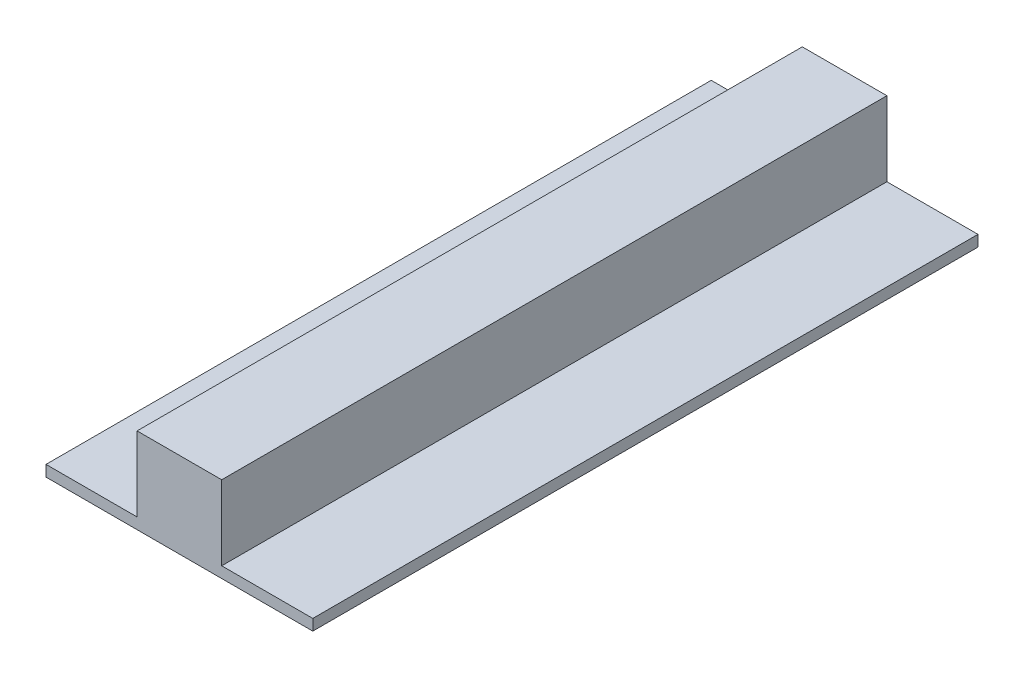
ISO-10303-21;
HEADER;
FILE_DESCRIPTION(('STEP AP214'),'2;1');
FILE_NAME('part.step','',(''),(''),'','','');
FILE_SCHEMA(('AUTOMOTIVE_DESIGN { 1 0 10303 214 1 1 1 1 }'));
ENDSEC;
DATA;
#1=APPLICATION_CONTEXT('core data for automotive mechanical design processes');
#2=APPLICATION_PROTOCOL_DEFINITION('international standard','automotive_design',2000,#1);
#3=PRODUCT_CONTEXT('',#1,'mechanical');
#4=PRODUCT('Part','Part','',(#3));
#5=PRODUCT_RELATED_PRODUCT_CATEGORY('part','',(#4));
#6=PRODUCT_DEFINITION_FORMATION('','',#4);
#7=PRODUCT_DEFINITION_CONTEXT('part definition',#1,'design');
#8=PRODUCT_DEFINITION('design','',#6,#7);
#9=PRODUCT_DEFINITION_SHAPE('','',#8);
#10=(LENGTH_UNIT() NAMED_UNIT(*) SI_UNIT(.MILLI.,.METRE.));
#11=(NAMED_UNIT(*) PLANE_ANGLE_UNIT() SI_UNIT($,.RADIAN.));
#12=(NAMED_UNIT(*) SI_UNIT($,.STERADIAN.) SOLID_ANGLE_UNIT());
#13=UNCERTAINTY_MEASURE_WITH_UNIT(LENGTH_MEASURE(1.E-05),#10,'distance_accuracy_value','');
#14=(GEOMETRIC_REPRESENTATION_CONTEXT(3) GLOBAL_UNCERTAINTY_ASSIGNED_CONTEXT((#13)) GLOBAL_UNIT_ASSIGNED_CONTEXT((#10,
#11,#12)) REPRESENTATION_CONTEXT('',''));
#15=CARTESIAN_POINT('',(0.,0.,0.));
#16=DIRECTION('',(0.,0.,1.));
#17=DIRECTION('',(1.,0.,0.));
#18=AXIS2_PLACEMENT_3D('',#15,#16,#17);
#19=CARTESIAN_POINT('',(48.3284264094905,-15.5,241.));
#20=DIRECTION('',(-1.,0.,0.));
#21=DIRECTION('',(0.,0.,1.));
#22=AXIS2_PLACEMENT_3D('',#19,#20,#21);
#23=PLANE('',#22);
#24=DIRECTION('',(0.,1.,0.));
#25=VECTOR('',#24,1.);
#26=CARTESIAN_POINT('',(48.3284264094905,-15.5,0.));
#27=LINE('',#26,#25);
#28=CARTESIAN_POINT('',(48.3284264094905,-15.5,0.));
#29=VERTEX_POINT('',#28);
#30=CARTESIAN_POINT('',(48.3284264094905,-11.5,0.));
#31=VERTEX_POINT('',#30);
#32=EDGE_CURVE('E129',#29,#31,#27,.T.);
#33=ORIENTED_EDGE('',*,*,#32,.T.);
#34=DIRECTION('',(0.,0.,-1.));
#35=VECTOR('',#34,1.);
#36=CARTESIAN_POINT('',(48.3284264094905,-11.5,241.));
#37=LINE('',#36,#35);
#38=CARTESIAN_POINT('',(48.3284264094905,-11.5,241.));
#39=VERTEX_POINT('',#38);
#40=EDGE_CURVE('E41',#39,#31,#37,.T.);
#41=ORIENTED_EDGE('',*,*,#40,.F.);
#42=DIRECTION('',(0.,1.,0.));
#43=VECTOR('',#42,1.);
#44=CARTESIAN_POINT('',(48.3284264094905,-15.5,241.));
#45=LINE('',#44,#43);
#46=CARTESIAN_POINT('',(48.3284264094905,-15.5,241.));
#47=VERTEX_POINT('',#46);
#48=EDGE_CURVE('E160',#47,#39,#45,.T.);
#49=ORIENTED_EDGE('',*,*,#48,.F.);
#50=DIRECTION('',(0.,0.,-1.));
#51=VECTOR('',#50,1.);
#52=CARTESIAN_POINT('',(48.3284264094905,-15.5,241.));
#53=LINE('',#52,#51);
#54=EDGE_CURVE('E11',#47,#29,#53,.T.);
#55=ORIENTED_EDGE('',*,*,#54,.T.);
#56=EDGE_LOOP('',(#33,#41,#49,#55));
#57=FACE_BOUND('',#56,.T.);
#58=ADVANCED_FACE('F33',(#57),#23,.F.);
#59=CARTESIAN_POINT('',(40.8284264094905,-11.5,241.));
#60=DIRECTION('',(0.,-1.,0.));
#61=DIRECTION('',(0.,0.,-1.));
#62=AXIS2_PLACEMENT_3D('',#59,#60,#61);
#63=PLANE('',#62);
#64=DIRECTION('',(-1.,0.,0.));
#65=VECTOR('',#64,1.);
#66=CARTESIAN_POINT('',(40.8284264094905,-11.5,0.));
#67=LINE('',#66,#65);
#68=CARTESIAN_POINT('',(15.3284264094905,-11.5,0.));
#69=VERTEX_POINT('',#68);
#70=EDGE_CURVE('E132',#31,#69,#67,.T.);
#71=ORIENTED_EDGE('',*,*,#70,.T.);
#72=DIRECTION('',(0.,0.,-1.));
#73=VECTOR('',#72,1.);
#74=CARTESIAN_POINT('',(15.3284264094905,-11.5,241.));
#75=LINE('',#74,#73);
#76=CARTESIAN_POINT('',(15.3284264094905,-11.5,241.));
#77=VERTEX_POINT('',#76);
#78=EDGE_CURVE('E149',#77,#69,#75,.T.);
#79=ORIENTED_EDGE('',*,*,#78,.F.);
#80=DIRECTION('',(-1.,0.,0.));
#81=VECTOR('',#80,1.);
#82=CARTESIAN_POINT('',(48.3284264094905,-11.5,241.));
#83=LINE('',#82,#81);
#84=EDGE_CURVE('E157',#39,#77,#83,.T.);
#85=ORIENTED_EDGE('',*,*,#84,.F.);
#86=ORIENTED_EDGE('',*,*,#40,.T.);
#87=EDGE_LOOP('',(#71,#79,#85,#86));
#88=FACE_BOUND('',#87,.T.);
#89=ADVANCED_FACE('F155',(#88),#63,.F.);
#90=CARTESIAN_POINT('',(15.3284264094905,-11.5,241.));
#91=DIRECTION('',(-1.,0.,0.));
#92=DIRECTION('',(0.,0.,1.));
#93=AXIS2_PLACEMENT_3D('',#90,#91,#92);
#94=PLANE('',#93);
#95=DIRECTION('',(0.,1.,0.));
#96=VECTOR('',#95,1.);
#97=CARTESIAN_POINT('',(15.3284264094905,-11.5,0.));
#98=LINE('',#97,#96);
#99=CARTESIAN_POINT('',(15.3284264094905,15.5,0.));
#100=VERTEX_POINT('',#99);
#101=EDGE_CURVE('E134',#69,#100,#98,.T.);
#102=ORIENTED_EDGE('',*,*,#101,.T.);
#103=DIRECTION('',(0.,0.,-1.));
#104=VECTOR('',#103,1.);
#105=CARTESIAN_POINT('',(15.3284264094905,15.5,241.));
#106=LINE('',#105,#104);
#107=CARTESIAN_POINT('',(15.3284264094905,15.5,241.));
#108=VERTEX_POINT('',#107);
#109=EDGE_CURVE('E146',#108,#100,#106,.T.);
#110=ORIENTED_EDGE('',*,*,#109,.F.);
#111=DIRECTION('',(0.,1.,0.));
#112=VECTOR('',#111,1.);
#113=CARTESIAN_POINT('',(15.3284264094905,-11.5,241.));
#114=LINE('',#113,#112);
#115=EDGE_CURVE('E173',#77,#108,#114,.T.);
#116=ORIENTED_EDGE('',*,*,#115,.F.);
#117=ORIENTED_EDGE('',*,*,#78,.T.);
#118=EDGE_LOOP('',(#102,#110,#116,#117));
#119=FACE_BOUND('',#118,.T.);
#120=ADVANCED_FACE('F169',(#119),#94,.F.);
#121=CARTESIAN_POINT('',(15.3284264094905,15.5,241.));
#122=DIRECTION('',(0.,-1.,0.));
#123=DIRECTION('',(0.,0.,-1.));
#124=AXIS2_PLACEMENT_3D('',#121,#122,#123);
#125=PLANE('',#124);
#126=DIRECTION('',(-1.,0.,0.));
#127=VECTOR('',#126,1.);
#128=CARTESIAN_POINT('',(15.3284264094905,15.5,0.));
#129=LINE('',#128,#127);
#130=CARTESIAN_POINT('',(-15.3284264094904,15.5,0.));
#131=VERTEX_POINT('',#130);
#132=EDGE_CURVE('E136',#100,#131,#129,.T.);
#133=ORIENTED_EDGE('',*,*,#132,.T.);
#134=DIRECTION('',(0.,0.,-1.));
#135=VECTOR('',#134,1.);
#136=CARTESIAN_POINT('',(-15.3284264094904,15.5,241.));
#137=LINE('',#136,#135);
#138=CARTESIAN_POINT('',(-15.3284264094904,15.5,241.));
#139=VERTEX_POINT('',#138);
#140=EDGE_CURVE('E118',#139,#131,#137,.T.);
#141=ORIENTED_EDGE('',*,*,#140,.F.);
#142=DIRECTION('',(-1.,0.,0.));
#143=VECTOR('',#142,1.);
#144=CARTESIAN_POINT('',(15.3284264094905,15.5,241.));
#145=LINE('',#144,#143);
#146=EDGE_CURVE('E108',#108,#139,#145,.T.);
#147=ORIENTED_EDGE('',*,*,#146,.F.);
#148=ORIENTED_EDGE('',*,*,#109,.T.);
#149=EDGE_LOOP('',(#133,#141,#147,#148));
#150=FACE_BOUND('',#149,.T.);
#151=ADVANCED_FACE('F172',(#150),#125,.F.);
#152=CARTESIAN_POINT('',(-15.3284264094904,15.5,241.));
#153=DIRECTION('',(1.,0.,0.));
#154=DIRECTION('',(0.,0.,-1.));
#155=AXIS2_PLACEMENT_3D('',#152,#153,#154);
#156=PLANE('',#155);
#157=DIRECTION('',(0.,-1.,0.));
#158=VECTOR('',#157,1.);
#159=CARTESIAN_POINT('',(-15.3284264094904,15.5,0.));
#160=LINE('',#159,#158);
#161=CARTESIAN_POINT('',(-15.3284264094904,-11.5,0.));
#162=VERTEX_POINT('',#161);
#163=EDGE_CURVE('E117',#131,#162,#160,.T.);
#164=ORIENTED_EDGE('',*,*,#163,.T.);
#165=DIRECTION('',(0.,0.,-1.));
#166=VECTOR('',#165,1.);
#167=CARTESIAN_POINT('',(-15.3284264094904,-11.5,241.));
#168=LINE('',#167,#166);
#169=CARTESIAN_POINT('',(-15.3284264094904,-11.5,241.));
#170=VERTEX_POINT('',#169);
#171=EDGE_CURVE('E114',#170,#162,#168,.T.);
#172=ORIENTED_EDGE('',*,*,#171,.F.);
#173=DIRECTION('',(0.,-1.,0.));
#174=VECTOR('',#173,1.);
#175=CARTESIAN_POINT('',(-15.3284264094904,15.5,241.));
#176=LINE('',#175,#174);
#177=EDGE_CURVE('E102',#139,#170,#176,.T.);
#178=ORIENTED_EDGE('',*,*,#177,.F.);
#179=ORIENTED_EDGE('',*,*,#140,.T.);
#180=EDGE_LOOP('',(#164,#172,#178,#179));
#181=FACE_BOUND('',#180,.T.);
#182=ADVANCED_FACE('F115',(#181),#156,.F.);
#183=CARTESIAN_POINT('',(-40.8284264094906,-11.5,241.));
#184=DIRECTION('',(0.,-1.,0.));
#185=DIRECTION('',(0.,0.,-1.));
#186=AXIS2_PLACEMENT_3D('',#183,#184,#185);
#187=PLANE('',#186);
#188=DIRECTION('',(-1.,0.,0.));
#189=VECTOR('',#188,1.);
#190=CARTESIAN_POINT('',(-40.8284264094906,-11.5,0.));
#191=LINE('',#190,#189);
#192=CARTESIAN_POINT('',(-48.3284264094904,-11.5,0.));
#193=VERTEX_POINT('',#192);
#194=EDGE_CURVE('E78',#162,#193,#191,.T.);
#195=ORIENTED_EDGE('',*,*,#194,.T.);
#196=DIRECTION('',(0.,0.,-1.));
#197=VECTOR('',#196,1.);
#198=CARTESIAN_POINT('',(-48.3284264094904,-11.5,241.));
#199=LINE('',#198,#197);
#200=CARTESIAN_POINT('',(-48.3284264094904,-11.5,241.));
#201=VERTEX_POINT('',#200);
#202=EDGE_CURVE('E119',#201,#193,#199,.T.);
#203=ORIENTED_EDGE('',*,*,#202,.F.);
#204=DIRECTION('',(-1.,0.,0.));
#205=VECTOR('',#204,1.);
#206=CARTESIAN_POINT('',(-15.3284264094904,-11.5,241.));
#207=LINE('',#206,#205);
#208=EDGE_CURVE('E106',#170,#201,#207,.T.);
#209=ORIENTED_EDGE('',*,*,#208,.F.);
#210=ORIENTED_EDGE('',*,*,#171,.T.);
#211=EDGE_LOOP('',(#195,#203,#209,#210));
#212=FACE_BOUND('',#211,.T.);
#213=ADVANCED_FACE('F121',(#212),#187,.F.);
#214=CARTESIAN_POINT('',(-48.3284264094904,-11.5,241.));
#215=DIRECTION('',(1.,0.,0.));
#216=DIRECTION('',(0.,0.,-1.));
#217=AXIS2_PLACEMENT_3D('',#214,#215,#216);
#218=PLANE('',#217);
#219=DIRECTION('',(0.,-1.,0.));
#220=VECTOR('',#219,1.);
#221=CARTESIAN_POINT('',(-48.3284264094904,-11.5,0.));
#222=LINE('',#221,#220);
#223=CARTESIAN_POINT('',(-48.3284264094904,-15.5,0.));
#224=VERTEX_POINT('',#223);
#225=EDGE_CURVE('E85',#193,#224,#222,.T.);
#226=ORIENTED_EDGE('',*,*,#225,.T.);
#227=DIRECTION('',(0.,0.,-1.));
#228=VECTOR('',#227,1.);
#229=CARTESIAN_POINT('',(-48.3284264094904,-15.5,241.));
#230=LINE('',#229,#228);
#231=CARTESIAN_POINT('',(-48.3284264094904,-15.5,241.));
#232=VERTEX_POINT('',#231);
#233=EDGE_CURVE('E125',#232,#224,#230,.T.);
#234=ORIENTED_EDGE('',*,*,#233,.F.);
#235=DIRECTION('',(0.,-1.,0.));
#236=VECTOR('',#235,1.);
#237=CARTESIAN_POINT('',(-48.3284264094904,-11.5,241.));
#238=LINE('',#237,#236);
#239=EDGE_CURVE('E123',#201,#232,#238,.T.);
#240=ORIENTED_EDGE('',*,*,#239,.F.);
#241=ORIENTED_EDGE('',*,*,#202,.T.);
#242=EDGE_LOOP('',(#226,#234,#240,#241));
#243=FACE_BOUND('',#242,.T.);
#244=ADVANCED_FACE('F216',(#243),#218,.F.);
#245=CARTESIAN_POINT('',(-48.3284264094904,-15.5,241.));
#246=DIRECTION('',(0.,1.,0.));
#247=DIRECTION('',(0.,0.,1.));
#248=AXIS2_PLACEMENT_3D('',#245,#246,#247);
#249=PLANE('',#248);
#250=DIRECTION('',(1.,0.,0.));
#251=VECTOR('',#250,1.);
#252=CARTESIAN_POINT('',(-48.3284264094904,-15.5,0.));
#253=LINE('',#252,#251);
#254=EDGE_CURVE('E141',#224,#29,#253,.T.);
#255=ORIENTED_EDGE('',*,*,#254,.T.);
#256=ORIENTED_EDGE('',*,*,#54,.F.);
#257=DIRECTION('',(1.,0.,0.));
#258=VECTOR('',#257,1.);
#259=CARTESIAN_POINT('',(-40.8284264094906,-15.5,241.));
#260=LINE('',#259,#258);
#261=EDGE_CURVE('E49',#232,#47,#260,.T.);
#262=ORIENTED_EDGE('',*,*,#261,.F.);
#263=ORIENTED_EDGE('',*,*,#233,.T.);
#264=EDGE_LOOP('',(#255,#256,#262,#263));
#265=FACE_BOUND('',#264,.T.);
#266=ADVANCED_FACE('F225',(#265),#249,.F.);
#267=CARTESIAN_POINT('',(0.,0.,241.));
#268=DIRECTION('',(0.,0.,1.));
#269=DIRECTION('',(1.,0.,0.));
#270=AXIS2_PLACEMENT_3D('',#267,#268,#269);
#271=PLANE('',#270);
#272=ORIENTED_EDGE('',*,*,#261,.T.);
#273=ORIENTED_EDGE('',*,*,#48,.T.);
#274=ORIENTED_EDGE('',*,*,#84,.T.);
#275=ORIENTED_EDGE('',*,*,#115,.T.);
#276=ORIENTED_EDGE('',*,*,#146,.T.);
#277=ORIENTED_EDGE('',*,*,#177,.T.);
#278=ORIENTED_EDGE('',*,*,#208,.T.);
#279=ORIENTED_EDGE('',*,*,#239,.T.);
#280=EDGE_LOOP('',(#272,#273,#274,#275,#276,#277,#278,#279));
#281=FACE_BOUND('',#280,.T.);
#282=ADVANCED_FACE('F104',(#281),#271,.T.);
#283=CARTESIAN_POINT('',(0.,0.,0.));
#284=DIRECTION('',(0.,0.,1.));
#285=DIRECTION('',(1.,0.,0.));
#286=AXIS2_PLACEMENT_3D('',#283,#284,#285);
#287=PLANE('',#286);
#288=ORIENTED_EDGE('',*,*,#32,.F.);
#289=ORIENTED_EDGE('',*,*,#254,.F.);
#290=ORIENTED_EDGE('',*,*,#225,.F.);
#291=ORIENTED_EDGE('',*,*,#194,.F.);
#292=ORIENTED_EDGE('',*,*,#163,.F.);
#293=ORIENTED_EDGE('',*,*,#132,.F.);
#294=ORIENTED_EDGE('',*,*,#101,.F.);
#295=ORIENTED_EDGE('',*,*,#70,.F.);
#296=EDGE_LOOP('',(#288,#289,#290,#291,#292,#293,#294,#295));
#297=FACE_BOUND('',#296,.T.);
#298=ADVANCED_FACE('F164',(#297),#287,.F.);
#299=CLOSED_SHELL('',(#58,#89,#120,#151,#182,#213,#244,#266,#282,#298));
#300=MANIFOLD_SOLID_BREP('B2',#299);
#301=ADVANCED_BREP_SHAPE_REPRESENTATION('',(#18,#300),#14);
#302=SHAPE_DEFINITION_REPRESENTATION(#9,#301);
ENDSEC;
END-ISO-10303-21;
